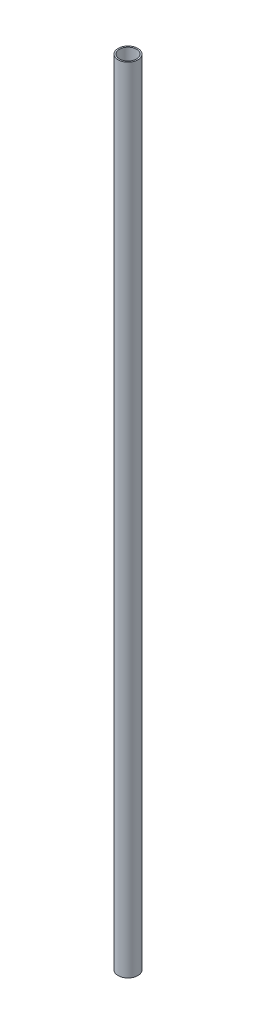
ISO-10303-21;
HEADER;
FILE_DESCRIPTION(('STEP AP214'),'2;1');
FILE_NAME('part.step','',(''),(''),'','','');
FILE_SCHEMA(('AUTOMOTIVE_DESIGN { 1 0 10303 214 1 1 1 1 }'));
ENDSEC;
DATA;
#1=APPLICATION_CONTEXT('core data for automotive mechanical design processes');
#2=APPLICATION_PROTOCOL_DEFINITION('international standard','automotive_design',2000,#1);
#3=PRODUCT_CONTEXT('',#1,'mechanical');
#4=PRODUCT('Part','Part','',(#3));
#5=PRODUCT_RELATED_PRODUCT_CATEGORY('part','',(#4));
#6=PRODUCT_DEFINITION_FORMATION('','',#4);
#7=PRODUCT_DEFINITION_CONTEXT('part definition',#1,'design');
#8=PRODUCT_DEFINITION('design','',#6,#7);
#9=PRODUCT_DEFINITION_SHAPE('','',#8);
#10=(LENGTH_UNIT() NAMED_UNIT(*) SI_UNIT(.MILLI.,.METRE.));
#11=(NAMED_UNIT(*) PLANE_ANGLE_UNIT() SI_UNIT($,.RADIAN.));
#12=(NAMED_UNIT(*) SI_UNIT($,.STERADIAN.) SOLID_ANGLE_UNIT());
#13=UNCERTAINTY_MEASURE_WITH_UNIT(LENGTH_MEASURE(1.E-05),#10,'distance_accuracy_value','');
#14=(GEOMETRIC_REPRESENTATION_CONTEXT(3) GLOBAL_UNCERTAINTY_ASSIGNED_CONTEXT((#13)) GLOBAL_UNIT_ASSIGNED_CONTEXT((#10,
#11,#12)) REPRESENTATION_CONTEXT('',''));
#15=CARTESIAN_POINT('',(0.,0.,0.));
#16=DIRECTION('',(0.,0.,1.));
#17=DIRECTION('',(1.,0.,0.));
#18=AXIS2_PLACEMENT_3D('',#15,#16,#17);
#19=CARTESIAN_POINT('',(0.,508.,0.));
#20=DIRECTION('',(0.,1.,0.));
#21=DIRECTION('',(0.,0.,1.));
#22=AXIS2_PLACEMENT_3D('',#19,#20,#21);
#23=PLANE('',#22);
#24=CARTESIAN_POINT('',(0.,508.,0.));
#25=DIRECTION('',(0.,1.,0.));
#26=DIRECTION('',(0.,0.,1.));
#27=AXIS2_PLACEMENT_3D('',#24,#25,#26);
#28=CIRCLE('',#27,6.35);
#29=CARTESIAN_POINT('',(0.,508.,6.35));
#30=VERTEX_POINT('',#29);
#31=EDGE_CURVE('E10',#30,#30,#28,.T.);
#32=ORIENTED_EDGE('',*,*,#31,.T.);
#33=EDGE_LOOP('',(#32));
#34=FACE_BOUND('',#33,.T.);
#35=CARTESIAN_POINT('',(0.,508.,0.));
#36=DIRECTION('',(0.,1.,0.));
#37=DIRECTION('',(0.,0.,1.));
#38=AXIS2_PLACEMENT_3D('',#35,#36,#37);
#39=CIRCLE('',#38,5.461);
#40=CARTESIAN_POINT('',(0.,508.,5.461));
#41=VERTEX_POINT('',#40);
#42=EDGE_CURVE('E50',#41,#41,#39,.T.);
#43=ORIENTED_EDGE('',*,*,#42,.F.);
#44=EDGE_LOOP('',(#43));
#45=FACE_BOUND('',#44,.T.);
#46=ADVANCED_FACE('F37',(#34,#45),#23,.T.);
#47=CARTESIAN_POINT('',(0.,0.,0.));
#48=DIRECTION('',(0.,1.,0.));
#49=DIRECTION('',(0.,0.,1.));
#50=AXIS2_PLACEMENT_3D('',#47,#48,#49);
#51=PLANE('',#50);
#52=CARTESIAN_POINT('',(0.,0.,0.));
#53=DIRECTION('',(0.,1.,0.));
#54=DIRECTION('',(0.,0.,1.));
#55=AXIS2_PLACEMENT_3D('',#52,#53,#54);
#56=CIRCLE('',#55,6.35);
#57=CARTESIAN_POINT('',(0.,0.,6.35));
#58=VERTEX_POINT('',#57);
#59=EDGE_CURVE('E41',#58,#58,#56,.T.);
#60=ORIENTED_EDGE('',*,*,#59,.F.);
#61=EDGE_LOOP('',(#60));
#62=FACE_BOUND('',#61,.T.);
#63=CARTESIAN_POINT('',(0.,0.,0.));
#64=DIRECTION('',(0.,1.,0.));
#65=DIRECTION('',(0.,0.,1.));
#66=AXIS2_PLACEMENT_3D('',#63,#64,#65);
#67=CIRCLE('',#66,5.461);
#68=CARTESIAN_POINT('',(0.,0.,5.461));
#69=VERTEX_POINT('',#68);
#70=EDGE_CURVE('E52',#69,#69,#67,.T.);
#71=ORIENTED_EDGE('',*,*,#70,.T.);
#72=EDGE_LOOP('',(#71));
#73=FACE_BOUND('',#72,.T.);
#74=ADVANCED_FACE('F64',(#62,#73),#51,.F.);
#75=CARTESIAN_POINT('',(0.,508.,0.));
#76=DIRECTION('',(0.,-1.,0.));
#77=DIRECTION('',(0.,0.,-1.));
#78=AXIS2_PLACEMENT_3D('',#75,#76,#77);
#79=CYLINDRICAL_SURFACE('',#78,6.35);
#80=ORIENTED_EDGE('',*,*,#31,.F.);
#81=EDGE_LOOP('',(#80));
#82=FACE_BOUND('',#81,.T.);
#83=ORIENTED_EDGE('',*,*,#59,.T.);
#84=EDGE_LOOP('',(#83));
#85=FACE_BOUND('',#84,.T.);
#86=ADVANCED_FACE('F39',(#82,#85),#79,.T.);
#87=CARTESIAN_POINT('',(0.,508.,0.));
#88=DIRECTION('',(0.,-1.,0.));
#89=DIRECTION('',(0.,0.,-1.));
#90=AXIS2_PLACEMENT_3D('',#87,#88,#89);
#91=CYLINDRICAL_SURFACE('',#90,5.461);
#92=ORIENTED_EDGE('',*,*,#42,.T.);
#93=EDGE_LOOP('',(#92));
#94=FACE_BOUND('',#93,.T.);
#95=ORIENTED_EDGE('',*,*,#70,.F.);
#96=EDGE_LOOP('',(#95));
#97=FACE_BOUND('',#96,.T.);
#98=ADVANCED_FACE('F60',(#94,#97),#91,.F.);
#99=CLOSED_SHELL('',(#46,#74,#86,#98));
#100=MANIFOLD_SOLID_BREP('B2',#99);
#101=ADVANCED_BREP_SHAPE_REPRESENTATION('',(#18,#100),#14);
#102=SHAPE_DEFINITION_REPRESENTATION(#9,#101);
ENDSEC;
END-ISO-10303-21;
